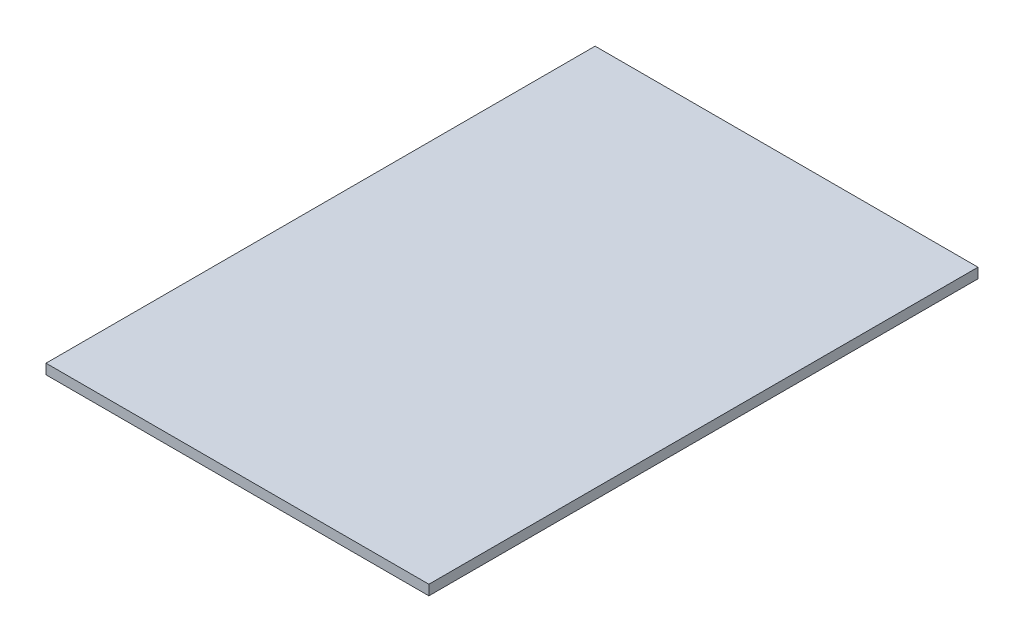
ISO-10303-21;
HEADER;
FILE_DESCRIPTION(('STEP AP214'),'2;1');
FILE_NAME('part.step','',(''),(''),'','','');
FILE_SCHEMA(('AUTOMOTIVE_DESIGN { 1 0 10303 214 1 1 1 1 }'));
ENDSEC;
DATA;
#1=APPLICATION_CONTEXT('core data for automotive mechanical design processes');
#2=APPLICATION_PROTOCOL_DEFINITION('international standard','automotive_design',2000,#1);
#3=PRODUCT_CONTEXT('',#1,'mechanical');
#4=PRODUCT('Part','Part','',(#3));
#5=PRODUCT_RELATED_PRODUCT_CATEGORY('part','',(#4));
#6=PRODUCT_DEFINITION_FORMATION('','',#4);
#7=PRODUCT_DEFINITION_CONTEXT('part definition',#1,'design');
#8=PRODUCT_DEFINITION('design','',#6,#7);
#9=PRODUCT_DEFINITION_SHAPE('','',#8);
#10=(LENGTH_UNIT() NAMED_UNIT(*) SI_UNIT(.MILLI.,.METRE.));
#11=(NAMED_UNIT(*) PLANE_ANGLE_UNIT() SI_UNIT($,.RADIAN.));
#12=(NAMED_UNIT(*) SI_UNIT($,.STERADIAN.) SOLID_ANGLE_UNIT());
#13=UNCERTAINTY_MEASURE_WITH_UNIT(LENGTH_MEASURE(1.E-05),#10,'distance_accuracy_value','');
#14=(GEOMETRIC_REPRESENTATION_CONTEXT(3) GLOBAL_UNCERTAINTY_ASSIGNED_CONTEXT((#13)) GLOBAL_UNIT_ASSIGNED_CONTEXT((#10,
#11,#12)) REPRESENTATION_CONTEXT('',''));
#15=CARTESIAN_POINT('',(0.,0.,0.));
#16=DIRECTION('',(0.,0.,1.));
#17=DIRECTION('',(1.,0.,0.));
#18=AXIS2_PLACEMENT_3D('',#15,#16,#17);
#19=CARTESIAN_POINT('',(78.,4.,109.));
#20=DIRECTION('',(0.,0.,-1.));
#21=DIRECTION('',(-1.,0.,0.));
#22=AXIS2_PLACEMENT_3D('',#19,#20,#21);
#23=PLANE('',#22);
#24=DIRECTION('',(1.,0.,0.));
#25=VECTOR('',#24,1.);
#26=CARTESIAN_POINT('',(78.,0.,109.));
#27=LINE('',#26,#25);
#28=CARTESIAN_POINT('',(-74.,0.,109.));
#29=VERTEX_POINT('',#28);
#30=CARTESIAN_POINT('',(78.,0.,109.));
#31=VERTEX_POINT('',#30);
#32=EDGE_CURVE('E95',#29,#31,#27,.T.);
#33=ORIENTED_EDGE('',*,*,#32,.T.);
#34=DIRECTION('',(0.,-1.,0.));
#35=VECTOR('',#34,1.);
#36=CARTESIAN_POINT('',(78.,4.,109.));
#37=LINE('',#36,#35);
#38=CARTESIAN_POINT('',(78.,4.,109.));
#39=VERTEX_POINT('',#38);
#40=EDGE_CURVE('E49',#39,#31,#37,.T.);
#41=ORIENTED_EDGE('',*,*,#40,.F.);
#42=DIRECTION('',(1.,0.,0.));
#43=VECTOR('',#42,1.);
#44=CARTESIAN_POINT('',(78.,4.,109.));
#45=LINE('',#44,#43);
#46=CARTESIAN_POINT('',(-74.,4.,109.));
#47=VERTEX_POINT('',#46);
#48=EDGE_CURVE('E87',#47,#39,#45,.T.);
#49=ORIENTED_EDGE('',*,*,#48,.F.);
#50=DIRECTION('',(0.,-1.,0.));
#51=VECTOR('',#50,1.);
#52=CARTESIAN_POINT('',(-74.,4.,109.));
#53=LINE('',#52,#51);
#54=EDGE_CURVE('E11',#47,#29,#53,.T.);
#55=ORIENTED_EDGE('',*,*,#54,.T.);
#56=EDGE_LOOP('',(#33,#41,#49,#55));
#57=FACE_BOUND('',#56,.T.);
#58=ADVANCED_FACE('F41',(#57),#23,.F.);
#59=CARTESIAN_POINT('',(78.,4.,-109.));
#60=DIRECTION('',(-1.,0.,0.));
#61=DIRECTION('',(0.,0.,1.));
#62=AXIS2_PLACEMENT_3D('',#59,#60,#61);
#63=PLANE('',#62);
#64=DIRECTION('',(0.,0.,-1.));
#65=VECTOR('',#64,1.);
#66=CARTESIAN_POINT('',(78.,0.,-109.));
#67=LINE('',#66,#65);
#68=CARTESIAN_POINT('',(78.,0.,-109.));
#69=VERTEX_POINT('',#68);
#70=EDGE_CURVE('E75',#31,#69,#67,.T.);
#71=ORIENTED_EDGE('',*,*,#70,.T.);
#72=DIRECTION('',(0.,-1.,0.));
#73=VECTOR('',#72,1.);
#74=CARTESIAN_POINT('',(78.,4.,-109.));
#75=LINE('',#74,#73);
#76=CARTESIAN_POINT('',(78.,4.,-109.));
#77=VERTEX_POINT('',#76);
#78=EDGE_CURVE('E96',#77,#69,#75,.T.);
#79=ORIENTED_EDGE('',*,*,#78,.F.);
#80=DIRECTION('',(0.,0.,-1.));
#81=VECTOR('',#80,1.);
#82=CARTESIAN_POINT('',(78.,4.,-109.));
#83=LINE('',#82,#81);
#84=EDGE_CURVE('E91',#39,#77,#83,.T.);
#85=ORIENTED_EDGE('',*,*,#84,.F.);
#86=ORIENTED_EDGE('',*,*,#40,.T.);
#87=EDGE_LOOP('',(#71,#79,#85,#86));
#88=FACE_BOUND('',#87,.T.);
#89=ADVANCED_FACE('F97',(#88),#63,.F.);
#90=CARTESIAN_POINT('',(-74.,4.,-109.));
#91=DIRECTION('',(0.,0.,1.));
#92=DIRECTION('',(1.,0.,0.));
#93=AXIS2_PLACEMENT_3D('',#90,#91,#92);
#94=PLANE('',#93);
#95=DIRECTION('',(-1.,0.,0.));
#96=VECTOR('',#95,1.);
#97=CARTESIAN_POINT('',(-74.,0.,-109.));
#98=LINE('',#97,#96);
#99=CARTESIAN_POINT('',(-74.,0.,-109.));
#100=VERTEX_POINT('',#99);
#101=EDGE_CURVE('E82',#69,#100,#98,.T.);
#102=ORIENTED_EDGE('',*,*,#101,.T.);
#103=DIRECTION('',(0.,-1.,0.));
#104=VECTOR('',#103,1.);
#105=CARTESIAN_POINT('',(-74.,4.,-109.));
#106=LINE('',#105,#104);
#107=CARTESIAN_POINT('',(-74.,4.,-109.));
#108=VERTEX_POINT('',#107);
#109=EDGE_CURVE('E101',#108,#100,#106,.T.);
#110=ORIENTED_EDGE('',*,*,#109,.F.);
#111=DIRECTION('',(-1.,0.,0.));
#112=VECTOR('',#111,1.);
#113=CARTESIAN_POINT('',(-74.,4.,-109.));
#114=LINE('',#113,#112);
#115=EDGE_CURVE('E99',#77,#108,#114,.T.);
#116=ORIENTED_EDGE('',*,*,#115,.F.);
#117=ORIENTED_EDGE('',*,*,#78,.T.);
#118=EDGE_LOOP('',(#102,#110,#116,#117));
#119=FACE_BOUND('',#118,.T.);
#120=ADVANCED_FACE('F111',(#119),#94,.F.);
#121=CARTESIAN_POINT('',(-74.,4.,-105.));
#122=DIRECTION('',(1.,0.,0.));
#123=DIRECTION('',(0.,0.,-1.));
#124=AXIS2_PLACEMENT_3D('',#121,#122,#123);
#125=PLANE('',#124);
#126=DIRECTION('',(0.,0.,1.));
#127=VECTOR('',#126,1.);
#128=CARTESIAN_POINT('',(-74.,0.,-105.));
#129=LINE('',#128,#127);
#130=EDGE_CURVE('E108',#100,#29,#129,.T.);
#131=ORIENTED_EDGE('',*,*,#130,.T.);
#132=ORIENTED_EDGE('',*,*,#54,.F.);
#133=DIRECTION('',(0.,0.,1.));
#134=VECTOR('',#133,1.);
#135=CARTESIAN_POINT('',(-74.,4.,-105.));
#136=LINE('',#135,#134);
#137=EDGE_CURVE('E57',#108,#47,#136,.T.);
#138=ORIENTED_EDGE('',*,*,#137,.F.);
#139=ORIENTED_EDGE('',*,*,#109,.T.);
#140=EDGE_LOOP('',(#131,#132,#138,#139));
#141=FACE_BOUND('',#140,.T.);
#142=ADVANCED_FACE('F115',(#141),#125,.F.);
#143=CARTESIAN_POINT('',(0.,4.,0.));
#144=DIRECTION('',(0.,-1.,0.));
#145=DIRECTION('',(0.,0.,-1.));
#146=AXIS2_PLACEMENT_3D('',#143,#144,#145);
#147=PLANE('',#146);
#148=ORIENTED_EDGE('',*,*,#137,.T.);
#149=ORIENTED_EDGE('',*,*,#48,.T.);
#150=ORIENTED_EDGE('',*,*,#84,.T.);
#151=ORIENTED_EDGE('',*,*,#115,.T.);
#152=EDGE_LOOP('',(#148,#149,#150,#151));
#153=FACE_BOUND('',#152,.T.);
#154=ADVANCED_FACE('F89',(#153),#147,.F.);
#155=CARTESIAN_POINT('',(0.,0.,0.));
#156=DIRECTION('',(0.,-1.,0.));
#157=DIRECTION('',(0.,0.,-1.));
#158=AXIS2_PLACEMENT_3D('',#155,#156,#157);
#159=PLANE('',#158);
#160=ORIENTED_EDGE('',*,*,#32,.F.);
#161=ORIENTED_EDGE('',*,*,#130,.F.);
#162=ORIENTED_EDGE('',*,*,#101,.F.);
#163=ORIENTED_EDGE('',*,*,#70,.F.);
#164=EDGE_LOOP('',(#160,#161,#162,#163));
#165=FACE_BOUND('',#164,.T.);
#166=ADVANCED_FACE('F114',(#165),#159,.T.);
#167=CLOSED_SHELL('',(#58,#89,#120,#142,#154,#166));
#168=MANIFOLD_SOLID_BREP('B2',#167);
#169=ADVANCED_BREP_SHAPE_REPRESENTATION('',(#18,#168),#14);
#170=SHAPE_DEFINITION_REPRESENTATION(#9,#169);
ENDSEC;
END-ISO-10303-21;
